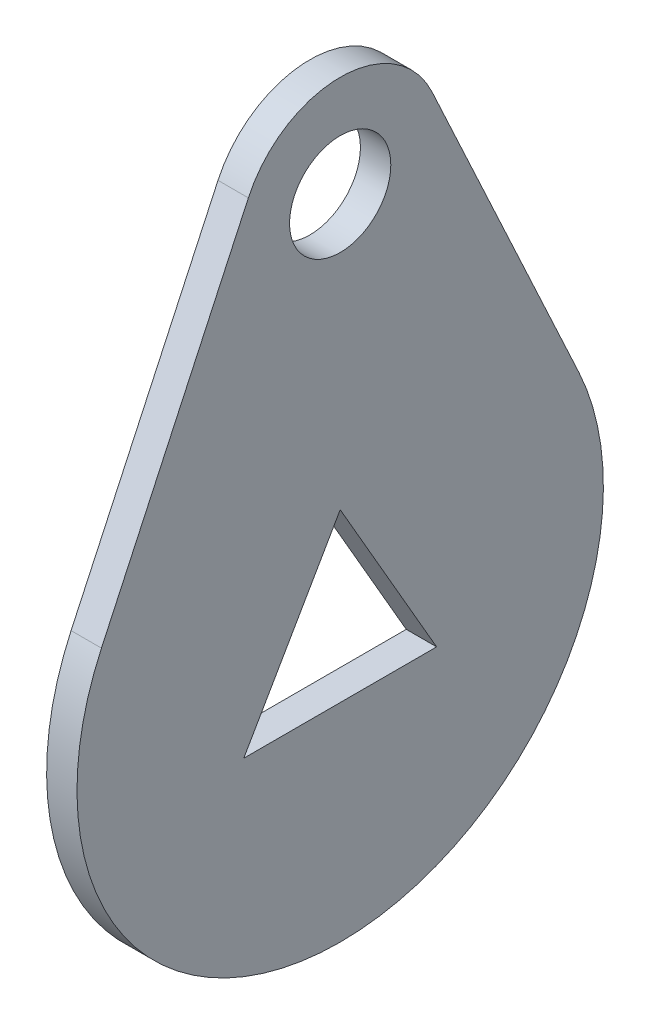
ISO-10303-21;
HEADER;
FILE_DESCRIPTION(('STEP AP214'),'2;1');
FILE_NAME('part.step','',(''),(''),'','','');
FILE_SCHEMA(('AUTOMOTIVE_DESIGN { 1 0 10303 214 1 1 1 1 }'));
ENDSEC;
DATA;
#1=APPLICATION_CONTEXT('core data for automotive mechanical design processes');
#2=APPLICATION_PROTOCOL_DEFINITION('international standard','automotive_design',2000,#1);
#3=PRODUCT_CONTEXT('',#1,'mechanical');
#4=PRODUCT('Part','Part','',(#3));
#5=PRODUCT_RELATED_PRODUCT_CATEGORY('part','',(#4));
#6=PRODUCT_DEFINITION_FORMATION('','',#4);
#7=PRODUCT_DEFINITION_CONTEXT('part definition',#1,'design');
#8=PRODUCT_DEFINITION('design','',#6,#7);
#9=PRODUCT_DEFINITION_SHAPE('','',#8);
#10=(LENGTH_UNIT() NAMED_UNIT(*) SI_UNIT(.MILLI.,.METRE.));
#11=(NAMED_UNIT(*) PLANE_ANGLE_UNIT() SI_UNIT($,.RADIAN.));
#12=(NAMED_UNIT(*) SI_UNIT($,.STERADIAN.) SOLID_ANGLE_UNIT());
#13=UNCERTAINTY_MEASURE_WITH_UNIT(LENGTH_MEASURE(1.E-05),#10,'distance_accuracy_value','');
#14=(GEOMETRIC_REPRESENTATION_CONTEXT(3) GLOBAL_UNCERTAINTY_ASSIGNED_CONTEXT((#13)) GLOBAL_UNIT_ASSIGNED_CONTEXT((#10,
#11,#12)) REPRESENTATION_CONTEXT('',''));
#15=CARTESIAN_POINT('',(0.,0.,0.));
#16=DIRECTION('',(0.,0.,1.));
#17=DIRECTION('',(1.,0.,0.));
#18=AXIS2_PLACEMENT_3D('',#15,#16,#17);
#19=CARTESIAN_POINT('',(1.5,5.47368421052632,-11.7914706955254));
#20=DIRECTION('',(0.,0.421052631578948,-0.90703620734811));
#21=DIRECTION('',(0.,0.90703620734811,0.421052631578948));
#22=AXIS2_PLACEMENT_3D('',#19,#20,#21);
#23=PLANE('',#22);
#24=DIRECTION('',(0.,-0.90703620734811,-0.421052631578948));
#25=VECTOR('',#24,1.);
#26=CARTESIAN_POINT('',(0.,5.47368421052632,-11.7914706955254));
#27=LINE('',#26,#25);
#28=CARTESIAN_POINT('',(0.,21.1052631578947,-4.53518103674055));
#29=VERTEX_POINT('',#28);
#30=CARTESIAN_POINT('',(0.,5.47368421052632,-11.7914706955254));
#31=VERTEX_POINT('',#30);
#32=EDGE_CURVE('E137',#29,#31,#27,.T.);
#33=ORIENTED_EDGE('',*,*,#32,.F.);
#34=DIRECTION('',(-1.,0.,0.));
#35=VECTOR('',#34,1.);
#36=CARTESIAN_POINT('',(1.5,21.1052631578947,-4.53518103674055));
#37=LINE('',#36,#35);
#38=CARTESIAN_POINT('',(1.5,21.1052631578947,-4.53518103674055));
#39=VERTEX_POINT('',#38);
#40=EDGE_CURVE('E11',#39,#29,#37,.T.);
#41=ORIENTED_EDGE('',*,*,#40,.F.);
#42=DIRECTION('',(0.,-0.90703620734811,-0.421052631578948));
#43=VECTOR('',#42,1.);
#44=CARTESIAN_POINT('',(1.5,5.47368421052632,-11.7914706955254));
#45=LINE('',#44,#43);
#46=CARTESIAN_POINT('',(1.5,5.47368421052632,-11.7914706955254));
#47=VERTEX_POINT('',#46);
#48=EDGE_CURVE('E110',#39,#47,#45,.T.);
#49=ORIENTED_EDGE('',*,*,#48,.T.);
#50=DIRECTION('',(-1.,0.,0.));
#51=VECTOR('',#50,1.);
#52=CARTESIAN_POINT('',(1.5,5.47368421052632,-11.7914706955254));
#53=LINE('',#52,#51);
#54=EDGE_CURVE('E86',#47,#31,#53,.T.);
#55=ORIENTED_EDGE('',*,*,#54,.T.);
#56=EDGE_LOOP('',(#33,#41,#49,#55));
#57=FACE_BOUND('',#56,.T.);
#58=ADVANCED_FACE('F36',(#57),#23,.T.);
#59=CARTESIAN_POINT('',(1.5,19.,0.));
#60=DIRECTION('',(-1.,0.,0.));
#61=DIRECTION('',(0.,0.,1.));
#62=AXIS2_PLACEMENT_3D('',#59,#60,#61);
#63=CYLINDRICAL_SURFACE('',#62,5.);
#64=CARTESIAN_POINT('',(0.,19.,0.));
#65=DIRECTION('',(1.,0.,0.));
#66=DIRECTION('',(0.,0.,-1.));
#67=AXIS2_PLACEMENT_3D('',#64,#65,#66);
#68=CIRCLE('',#67,5.);
#69=CARTESIAN_POINT('',(0.,21.1052631578947,4.53518103674055));
#70=VERTEX_POINT('',#69);
#71=EDGE_CURVE('E116',#29,#70,#68,.T.);
#72=ORIENTED_EDGE('',*,*,#71,.T.);
#73=DIRECTION('',(-1.,0.,0.));
#74=VECTOR('',#73,1.);
#75=CARTESIAN_POINT('',(1.5,21.1052631578947,4.53518103674055));
#76=LINE('',#75,#74);
#77=CARTESIAN_POINT('',(1.5,21.1052631578947,4.53518103674055));
#78=VERTEX_POINT('',#77);
#79=EDGE_CURVE('E46',#78,#70,#76,.T.);
#80=ORIENTED_EDGE('',*,*,#79,.F.);
#81=CARTESIAN_POINT('',(1.5,19.,0.));
#82=DIRECTION('',(1.,0.,0.));
#83=DIRECTION('',(0.,0.,-1.));
#84=AXIS2_PLACEMENT_3D('',#81,#82,#83);
#85=CIRCLE('',#84,5.);
#86=EDGE_CURVE('E105',#39,#78,#85,.T.);
#87=ORIENTED_EDGE('',*,*,#86,.F.);
#88=ORIENTED_EDGE('',*,*,#40,.T.);
#89=EDGE_LOOP('',(#72,#80,#87,#88));
#90=FACE_BOUND('',#89,.T.);
#91=ADVANCED_FACE('F114',(#90),#63,.T.);
#92=CARTESIAN_POINT('',(1.5,5.47368421052632,11.7914706955254));
#93=DIRECTION('',(0.,0.421052631578947,0.90703620734811));
#94=DIRECTION('',(0.,-0.90703620734811,0.421052631578947));
#95=AXIS2_PLACEMENT_3D('',#92,#93,#94);
#96=PLANE('',#95);
#97=DIRECTION('',(0.,0.90703620734811,-0.421052631578947));
#98=VECTOR('',#97,1.);
#99=CARTESIAN_POINT('',(0.,5.47368421052632,11.7914706955254));
#100=LINE('',#99,#98);
#101=CARTESIAN_POINT('',(0.,5.47368421052632,11.7914706955254));
#102=VERTEX_POINT('',#101);
#103=EDGE_CURVE('E141',#102,#70,#100,.T.);
#104=ORIENTED_EDGE('',*,*,#103,.F.);
#105=DIRECTION('',(-1.,0.,0.));
#106=VECTOR('',#105,1.);
#107=CARTESIAN_POINT('',(1.5,5.47368421052632,11.7914706955254));
#108=LINE('',#107,#106);
#109=CARTESIAN_POINT('',(1.5,5.47368421052632,11.7914706955254));
#110=VERTEX_POINT('',#109);
#111=EDGE_CURVE('E79',#110,#102,#108,.T.);
#112=ORIENTED_EDGE('',*,*,#111,.F.);
#113=DIRECTION('',(0.,0.90703620734811,-0.421052631578947));
#114=VECTOR('',#113,1.);
#115=CARTESIAN_POINT('',(1.5,5.47368421052632,11.7914706955254));
#116=LINE('',#115,#114);
#117=EDGE_CURVE('E109',#110,#78,#116,.T.);
#118=ORIENTED_EDGE('',*,*,#117,.T.);
#119=ORIENTED_EDGE('',*,*,#79,.T.);
#120=EDGE_LOOP('',(#104,#112,#118,#119));
#121=FACE_BOUND('',#120,.T.);
#122=ADVANCED_FACE('F121',(#121),#96,.T.);
#123=CARTESIAN_POINT('',(1.5,1.37500000000002,2.38156986040722));
#124=DIRECTION('',(0.,0.500000000000004,0.866025403784436));
#125=DIRECTION('',(0.,-0.866025403784436,0.500000000000004));
#126=AXIS2_PLACEMENT_3D('',#123,#124,#125);
#127=PLANE('',#126);
#128=DIRECTION('',(0.,0.866025403784436,-0.500000000000004));
#129=VECTOR('',#128,1.);
#130=CARTESIAN_POINT('',(0.,1.37500000000002,2.38156986040722));
#131=LINE('',#130,#129);
#132=CARTESIAN_POINT('',(0.,-2.75,4.76313972081446));
#133=VERTEX_POINT('',#132);
#134=CARTESIAN_POINT('',(0.,5.5,0.));
#135=VERTEX_POINT('',#134);
#136=EDGE_CURVE('E127',#133,#135,#131,.T.);
#137=ORIENTED_EDGE('',*,*,#136,.T.);
#138=DIRECTION('',(-1.,0.,0.));
#139=VECTOR('',#138,1.);
#140=CARTESIAN_POINT('',(1.5,5.5,0.));
#141=LINE('',#140,#139);
#142=CARTESIAN_POINT('',(1.5,5.5,0.));
#143=VERTEX_POINT('',#142);
#144=EDGE_CURVE('E40',#143,#135,#141,.T.);
#145=ORIENTED_EDGE('',*,*,#144,.F.);
#146=DIRECTION('',(0.,0.866025403784436,-0.500000000000004));
#147=VECTOR('',#146,1.);
#148=CARTESIAN_POINT('',(1.5,1.37500000000002,2.38156986040722));
#149=LINE('',#148,#147);
#150=CARTESIAN_POINT('',(1.5,-2.75,4.76313972081446));
#151=VERTEX_POINT('',#150);
#152=EDGE_CURVE('E145',#151,#143,#149,.T.);
#153=ORIENTED_EDGE('',*,*,#152,.F.);
#154=DIRECTION('',(-1.,0.,0.));
#155=VECTOR('',#154,1.);
#156=CARTESIAN_POINT('',(1.5,-2.75,4.76313972081446));
#157=LINE('',#156,#155);
#158=EDGE_CURVE('E123',#151,#133,#157,.T.);
#159=ORIENTED_EDGE('',*,*,#158,.T.);
#160=EDGE_LOOP('',(#137,#145,#153,#159));
#161=FACE_BOUND('',#160,.T.);
#162=ADVANCED_FACE('F38',(#161),#127,.F.);
#163=CARTESIAN_POINT('',(1.5,1.37500000000002,-2.38156986040722));
#164=DIRECTION('',(0.,0.500000000000004,-0.866025403784436));
#165=DIRECTION('',(0.,0.866025403784436,0.500000000000004));
#166=AXIS2_PLACEMENT_3D('',#163,#164,#165);
#167=PLANE('',#166);
#168=DIRECTION('',(0.,-0.866025403784436,-0.500000000000004));
#169=VECTOR('',#168,1.);
#170=CARTESIAN_POINT('',(0.,1.37500000000002,-2.38156986040722));
#171=LINE('',#170,#169);
#172=CARTESIAN_POINT('',(0.,-2.75,-4.76313972081447));
#173=VERTEX_POINT('',#172);
#174=EDGE_CURVE('E130',#135,#173,#171,.T.);
#175=ORIENTED_EDGE('',*,*,#174,.T.);
#176=DIRECTION('',(-1.,0.,0.));
#177=VECTOR('',#176,1.);
#178=CARTESIAN_POINT('',(1.5,-2.75,-4.76313972081447));
#179=LINE('',#178,#177);
#180=CARTESIAN_POINT('',(1.5,-2.75,-4.76313972081447));
#181=VERTEX_POINT('',#180);
#182=EDGE_CURVE('E149',#181,#173,#179,.T.);
#183=ORIENTED_EDGE('',*,*,#182,.F.);
#184=DIRECTION('',(0.,-0.866025403784436,-0.500000000000004));
#185=VECTOR('',#184,1.);
#186=CARTESIAN_POINT('',(1.5,1.37500000000002,-2.38156986040722));
#187=LINE('',#186,#185);
#188=EDGE_CURVE('E94',#143,#181,#187,.T.);
#189=ORIENTED_EDGE('',*,*,#188,.F.);
#190=ORIENTED_EDGE('',*,*,#144,.T.);
#191=EDGE_LOOP('',(#175,#183,#189,#190));
#192=FACE_BOUND('',#191,.T.);
#193=ADVANCED_FACE('F155',(#192),#167,.F.);
#194=CARTESIAN_POINT('',(1.5,19.,0.));
#195=DIRECTION('',(-1.,0.,0.));
#196=DIRECTION('',(0.,0.,1.));
#197=AXIS2_PLACEMENT_3D('',#194,#195,#196);
#198=CYLINDRICAL_SURFACE('',#197,2.5);
#199=CARTESIAN_POINT('',(1.5,19.,0.));
#200=DIRECTION('',(1.,0.,0.));
#201=DIRECTION('',(0.,0.,-1.));
#202=AXIS2_PLACEMENT_3D('',#199,#200,#201);
#203=CIRCLE('',#202,2.5);
#204=CARTESIAN_POINT('',(1.5,19.,-2.5));
#205=VERTEX_POINT('',#204);
#206=EDGE_CURVE('E170',#205,#205,#203,.T.);
#207=ORIENTED_EDGE('',*,*,#206,.T.);
#208=EDGE_LOOP('',(#207));
#209=FACE_BOUND('',#208,.T.);
#210=CARTESIAN_POINT('',(0.,19.,0.));
#211=DIRECTION('',(1.,0.,0.));
#212=DIRECTION('',(0.,0.,-1.));
#213=AXIS2_PLACEMENT_3D('',#210,#211,#212);
#214=CIRCLE('',#213,2.5);
#215=CARTESIAN_POINT('',(0.,19.,-2.5));
#216=VERTEX_POINT('',#215);
#217=EDGE_CURVE('E134',#216,#216,#214,.T.);
#218=ORIENTED_EDGE('',*,*,#217,.F.);
#219=EDGE_LOOP('',(#218));
#220=FACE_BOUND('',#219,.T.);
#221=ADVANCED_FACE('F181',(#209,#220),#198,.F.);
#222=CARTESIAN_POINT('',(1.5,-2.75,0.));
#223=DIRECTION('',(0.,-1.,0.));
#224=DIRECTION('',(0.,0.,-1.));
#225=AXIS2_PLACEMENT_3D('',#222,#223,#224);
#226=PLANE('',#225);
#227=DIRECTION('',(0.,0.,1.));
#228=VECTOR('',#227,1.);
#229=CARTESIAN_POINT('',(0.,-2.75,0.));
#230=LINE('',#229,#228);
#231=EDGE_CURVE('E132',#173,#133,#230,.T.);
#232=ORIENTED_EDGE('',*,*,#231,.T.);
#233=ORIENTED_EDGE('',*,*,#158,.F.);
#234=DIRECTION('',(0.,0.,1.));
#235=VECTOR('',#234,1.);
#236=CARTESIAN_POINT('',(1.5,-2.75,0.));
#237=LINE('',#236,#235);
#238=EDGE_CURVE('E164',#181,#151,#237,.T.);
#239=ORIENTED_EDGE('',*,*,#238,.F.);
#240=ORIENTED_EDGE('',*,*,#182,.T.);
#241=EDGE_LOOP('',(#232,#233,#239,#240));
#242=FACE_BOUND('',#241,.T.);
#243=ADVANCED_FACE('F163',(#242),#226,.F.);
#244=CARTESIAN_POINT('',(1.5,0.,0.));
#245=DIRECTION('',(-1.,0.,0.));
#246=DIRECTION('',(0.,0.,1.));
#247=AXIS2_PLACEMENT_3D('',#244,#245,#246);
#248=CYLINDRICAL_SURFACE('',#247,13.);
#249=CARTESIAN_POINT('',(0.,0.,0.));
#250=DIRECTION('',(1.,0.,0.));
#251=DIRECTION('',(0.,0.,-1.));
#252=AXIS2_PLACEMENT_3D('',#249,#250,#251);
#253=CIRCLE('',#252,13.);
#254=EDGE_CURVE('E143',#102,#31,#253,.T.);
#255=ORIENTED_EDGE('',*,*,#254,.T.);
#256=ORIENTED_EDGE('',*,*,#54,.F.);
#257=CARTESIAN_POINT('',(1.5,0.,0.));
#258=DIRECTION('',(1.,0.,0.));
#259=DIRECTION('',(0.,0.,-1.));
#260=AXIS2_PLACEMENT_3D('',#257,#258,#259);
#261=CIRCLE('',#260,13.);
#262=EDGE_CURVE('E55',#110,#47,#261,.T.);
#263=ORIENTED_EDGE('',*,*,#262,.F.);
#264=ORIENTED_EDGE('',*,*,#111,.T.);
#265=EDGE_LOOP('',(#255,#256,#263,#264));
#266=FACE_BOUND('',#265,.T.);
#267=ADVANCED_FACE('F173',(#266),#248,.T.);
#268=CARTESIAN_POINT('',(1.5,0.,0.));
#269=DIRECTION('',(1.,0.,0.));
#270=DIRECTION('',(0.,0.,-1.));
#271=AXIS2_PLACEMENT_3D('',#268,#269,#270);
#272=PLANE('',#271);
#273=ORIENTED_EDGE('',*,*,#152,.T.);
#274=ORIENTED_EDGE('',*,*,#188,.T.);
#275=ORIENTED_EDGE('',*,*,#238,.T.);
#276=EDGE_LOOP('',(#273,#274,#275));
#277=FACE_BOUND('',#276,.T.);
#278=ORIENTED_EDGE('',*,*,#206,.F.);
#279=EDGE_LOOP('',(#278));
#280=FACE_BOUND('',#279,.T.);
#281=ORIENTED_EDGE('',*,*,#48,.F.);
#282=ORIENTED_EDGE('',*,*,#86,.T.);
#283=ORIENTED_EDGE('',*,*,#117,.F.);
#284=ORIENTED_EDGE('',*,*,#262,.T.);
#285=EDGE_LOOP('',(#281,#282,#283,#284));
#286=FACE_BOUND('',#285,.T.);
#287=ADVANCED_FACE('F107',(#277,#280,#286),#272,.T.);
#288=CARTESIAN_POINT('',(0.,0.,0.));
#289=DIRECTION('',(1.,0.,0.));
#290=DIRECTION('',(0.,0.,-1.));
#291=AXIS2_PLACEMENT_3D('',#288,#289,#290);
#292=PLANE('',#291);
#293=ORIENTED_EDGE('',*,*,#136,.F.);
#294=ORIENTED_EDGE('',*,*,#231,.F.);
#295=ORIENTED_EDGE('',*,*,#174,.F.);
#296=EDGE_LOOP('',(#293,#294,#295));
#297=FACE_BOUND('',#296,.T.);
#298=ORIENTED_EDGE('',*,*,#217,.T.);
#299=EDGE_LOOP('',(#298));
#300=FACE_BOUND('',#299,.T.);
#301=ORIENTED_EDGE('',*,*,#32,.T.);
#302=ORIENTED_EDGE('',*,*,#254,.F.);
#303=ORIENTED_EDGE('',*,*,#103,.T.);
#304=ORIENTED_EDGE('',*,*,#71,.F.);
#305=EDGE_LOOP('',(#301,#302,#303,#304));
#306=FACE_BOUND('',#305,.T.);
#307=ADVANCED_FACE('F161',(#297,#300,#306),#292,.F.);
#308=CLOSED_SHELL('',(#58,#91,#122,#162,#193,#221,#243,#267,#287,#307));
#309=MANIFOLD_SOLID_BREP('B2',#308);
#310=ADVANCED_BREP_SHAPE_REPRESENTATION('',(#18,#309),#14);
#311=SHAPE_DEFINITION_REPRESENTATION(#9,#310);
ENDSEC;
END-ISO-10303-21;
